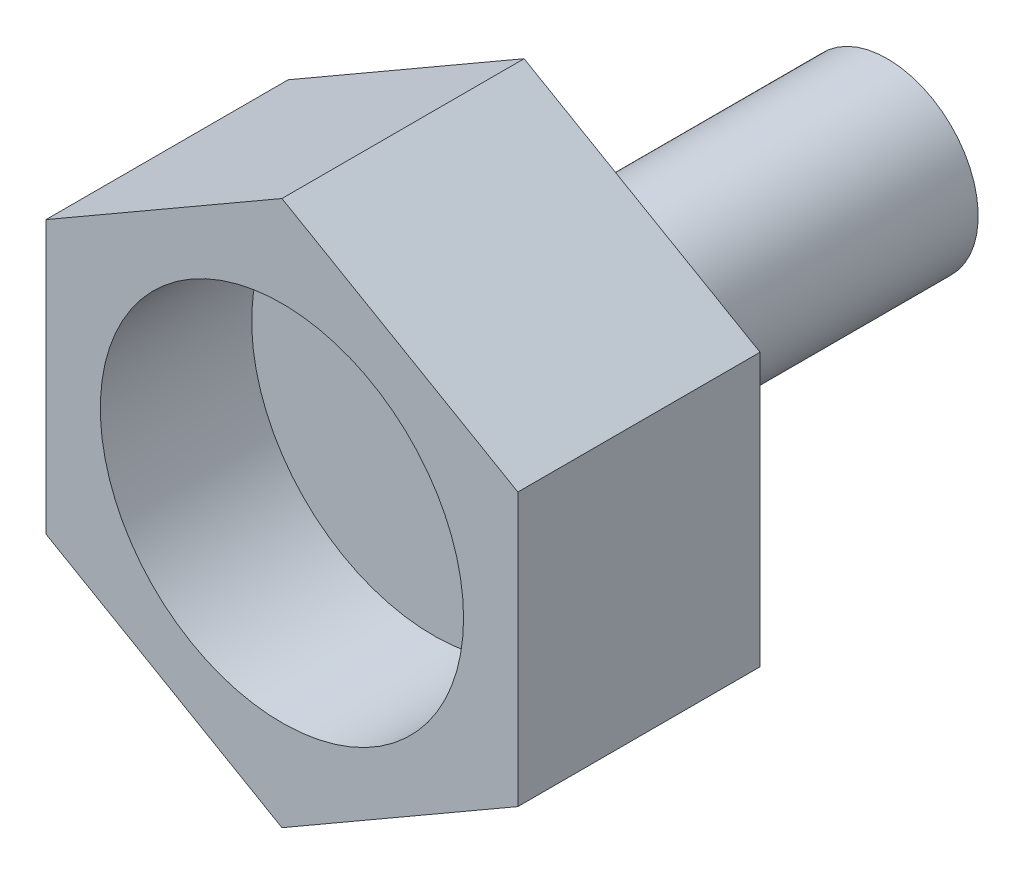
ISO-10303-21;
HEADER;
FILE_DESCRIPTION(('STEP AP214'),'2;1');
FILE_NAME('part.step','',(''),(''),'','','');
FILE_SCHEMA(('AUTOMOTIVE_DESIGN { 1 0 10303 214 1 1 1 1 }'));
ENDSEC;
DATA;
#1=APPLICATION_CONTEXT('core data for automotive mechanical design processes');
#2=APPLICATION_PROTOCOL_DEFINITION('international standard','automotive_design',2000,#1);
#3=PRODUCT_CONTEXT('',#1,'mechanical');
#4=PRODUCT('Part','Part','',(#3));
#5=PRODUCT_RELATED_PRODUCT_CATEGORY('part','',(#4));
#6=PRODUCT_DEFINITION_FORMATION('','',#4);
#7=PRODUCT_DEFINITION_CONTEXT('part definition',#1,'design');
#8=PRODUCT_DEFINITION('design','',#6,#7);
#9=PRODUCT_DEFINITION_SHAPE('','',#8);
#10=(LENGTH_UNIT() NAMED_UNIT(*) SI_UNIT(.MILLI.,.METRE.));
#11=(NAMED_UNIT(*) PLANE_ANGLE_UNIT() SI_UNIT($,.RADIAN.));
#12=(NAMED_UNIT(*) SI_UNIT($,.STERADIAN.) SOLID_ANGLE_UNIT());
#13=UNCERTAINTY_MEASURE_WITH_UNIT(LENGTH_MEASURE(1.E-05),#10,'distance_accuracy_value','');
#14=(GEOMETRIC_REPRESENTATION_CONTEXT(3) GLOBAL_UNCERTAINTY_ASSIGNED_CONTEXT((#13)) GLOBAL_UNIT_ASSIGNED_CONTEXT((#10,
#11,#12)) REPRESENTATION_CONTEXT('',''));
#15=CARTESIAN_POINT('',(0.,0.,0.));
#16=DIRECTION('',(0.,0.,1.));
#17=DIRECTION('',(1.,0.,0.));
#18=AXIS2_PLACEMENT_3D('',#15,#16,#17);
#19=CARTESIAN_POINT('',(0.,-4.5,4.));
#20=DIRECTION('',(-0.5,0.866025403784439,0.));
#21=DIRECTION('',(-0.866025403784439,-0.5,0.));
#22=AXIS2_PLACEMENT_3D('',#19,#20,#21);
#23=PLANE('',#22);
#24=DIRECTION('',(0.866025403784439,0.5,0.));
#25=VECTOR('',#24,1.);
#26=CARTESIAN_POINT('',(0.,-4.5,0.));
#27=LINE('',#26,#25);
#28=CARTESIAN_POINT('',(0.,-4.5,0.));
#29=VERTEX_POINT('',#28);
#30=CARTESIAN_POINT('',(3.89711431702997,-2.25,0.));
#31=VERTEX_POINT('',#30);
#32=EDGE_CURVE('E119',#29,#31,#27,.T.);
#33=ORIENTED_EDGE('',*,*,#32,.T.);
#34=DIRECTION('',(0.,0.,-1.));
#35=VECTOR('',#34,1.);
#36=CARTESIAN_POINT('',(3.89711431702997,-2.25,4.));
#37=LINE('',#36,#35);
#38=CARTESIAN_POINT('',(3.89711431702997,-2.25,4.));
#39=VERTEX_POINT('',#38);
#40=EDGE_CURVE('E36',#39,#31,#37,.T.);
#41=ORIENTED_EDGE('',*,*,#40,.F.);
#42=DIRECTION('',(0.866025403784439,0.5,0.));
#43=VECTOR('',#42,1.);
#44=CARTESIAN_POINT('',(0.,-4.5,4.));
#45=LINE('',#44,#43);
#46=CARTESIAN_POINT('',(0.,-4.5,4.));
#47=VERTEX_POINT('',#46);
#48=EDGE_CURVE('E130',#47,#39,#45,.T.);
#49=ORIENTED_EDGE('',*,*,#48,.F.);
#50=DIRECTION('',(0.,0.,-1.));
#51=VECTOR('',#50,1.);
#52=CARTESIAN_POINT('',(0.,-4.5,4.));
#53=LINE('',#52,#51);
#54=EDGE_CURVE('E115',#47,#29,#53,.T.);
#55=ORIENTED_EDGE('',*,*,#54,.T.);
#56=EDGE_LOOP('',(#33,#41,#49,#55));
#57=FACE_BOUND('',#56,.T.);
#58=ADVANCED_FACE('F33',(#57),#23,.F.);
#59=CARTESIAN_POINT('',(3.89711431702997,-2.25,4.));
#60=DIRECTION('',(-1.,0.,0.));
#61=DIRECTION('',(0.,-1.,0.));
#62=AXIS2_PLACEMENT_3D('',#59,#60,#61);
#63=PLANE('',#62);
#64=DIRECTION('',(0.,1.,0.));
#65=VECTOR('',#64,1.);
#66=CARTESIAN_POINT('',(3.89711431702997,-2.25,0.));
#67=LINE('',#66,#65);
#68=CARTESIAN_POINT('',(3.89711431702997,2.25,0.));
#69=VERTEX_POINT('',#68);
#70=EDGE_CURVE('E122',#31,#69,#67,.T.);
#71=ORIENTED_EDGE('',*,*,#70,.T.);
#72=DIRECTION('',(0.,0.,-1.));
#73=VECTOR('',#72,1.);
#74=CARTESIAN_POINT('',(3.89711431702997,2.25,4.));
#75=LINE('',#74,#73);
#76=CARTESIAN_POINT('',(3.89711431702997,2.25,4.));
#77=VERTEX_POINT('',#76);
#78=EDGE_CURVE('E133',#77,#69,#75,.T.);
#79=ORIENTED_EDGE('',*,*,#78,.F.);
#80=DIRECTION('',(0.,1.,0.));
#81=VECTOR('',#80,1.);
#82=CARTESIAN_POINT('',(3.89711431702997,-2.25,4.));
#83=LINE('',#82,#81);
#84=EDGE_CURVE('E88',#39,#77,#83,.T.);
#85=ORIENTED_EDGE('',*,*,#84,.F.);
#86=ORIENTED_EDGE('',*,*,#40,.T.);
#87=EDGE_LOOP('',(#71,#79,#85,#86));
#88=FACE_BOUND('',#87,.T.);
#89=ADVANCED_FACE('F138',(#88),#63,.F.);
#90=CARTESIAN_POINT('',(3.89711431702997,2.25,4.));
#91=DIRECTION('',(-0.5,-0.866025403784439,0.));
#92=DIRECTION('',(0.866025403784439,-0.5,0.));
#93=AXIS2_PLACEMENT_3D('',#90,#91,#92);
#94=PLANE('',#93);
#95=DIRECTION('',(-0.866025403784439,0.5,0.));
#96=VECTOR('',#95,1.);
#97=CARTESIAN_POINT('',(3.89711431702997,2.25,0.));
#98=LINE('',#97,#96);
#99=CARTESIAN_POINT('',(0.,4.5,0.));
#100=VERTEX_POINT('',#99);
#101=EDGE_CURVE('E125',#69,#100,#98,.T.);
#102=ORIENTED_EDGE('',*,*,#101,.T.);
#103=DIRECTION('',(0.,0.,-1.));
#104=VECTOR('',#103,1.);
#105=CARTESIAN_POINT('',(0.,4.5,4.));
#106=LINE('',#105,#104);
#107=CARTESIAN_POINT('',(0.,4.5,4.));
#108=VERTEX_POINT('',#107);
#109=EDGE_CURVE('E110',#108,#100,#106,.T.);
#110=ORIENTED_EDGE('',*,*,#109,.F.);
#111=DIRECTION('',(-0.866025403784439,0.5,0.));
#112=VECTOR('',#111,1.);
#113=CARTESIAN_POINT('',(3.89711431702997,2.25,4.));
#114=LINE('',#113,#112);
#115=EDGE_CURVE('E101',#77,#108,#114,.T.);
#116=ORIENTED_EDGE('',*,*,#115,.F.);
#117=ORIENTED_EDGE('',*,*,#78,.T.);
#118=EDGE_LOOP('',(#102,#110,#116,#117));
#119=FACE_BOUND('',#118,.T.);
#120=ADVANCED_FACE('F144',(#119),#94,.F.);
#121=CARTESIAN_POINT('',(0.,4.5,4.));
#122=DIRECTION('',(0.5,-0.866025403784439,0.));
#123=DIRECTION('',(0.866025403784439,0.5,0.));
#124=AXIS2_PLACEMENT_3D('',#121,#122,#123);
#125=PLANE('',#124);
#126=DIRECTION('',(-0.866025403784439,-0.5,0.));
#127=VECTOR('',#126,1.);
#128=CARTESIAN_POINT('',(0.,4.5,0.));
#129=LINE('',#128,#127);
#130=CARTESIAN_POINT('',(-3.89711431702997,2.25,0.));
#131=VERTEX_POINT('',#130);
#132=EDGE_CURVE('E109',#100,#131,#129,.T.);
#133=ORIENTED_EDGE('',*,*,#132,.T.);
#134=DIRECTION('',(0.,0.,-1.));
#135=VECTOR('',#134,1.);
#136=CARTESIAN_POINT('',(-3.89711431702997,2.25,4.));
#137=LINE('',#136,#135);
#138=CARTESIAN_POINT('',(-3.89711431702997,2.25,4.));
#139=VERTEX_POINT('',#138);
#140=EDGE_CURVE('E106',#139,#131,#137,.T.);
#141=ORIENTED_EDGE('',*,*,#140,.F.);
#142=DIRECTION('',(-0.866025403784439,-0.5,0.));
#143=VECTOR('',#142,1.);
#144=CARTESIAN_POINT('',(0.,4.5,4.));
#145=LINE('',#144,#143);
#146=EDGE_CURVE('E95',#108,#139,#145,.T.);
#147=ORIENTED_EDGE('',*,*,#146,.F.);
#148=ORIENTED_EDGE('',*,*,#109,.T.);
#149=EDGE_LOOP('',(#133,#141,#147,#148));
#150=FACE_BOUND('',#149,.T.);
#151=ADVANCED_FACE('F107',(#150),#125,.F.);
#152=CARTESIAN_POINT('',(-3.89711431702997,2.25,4.));
#153=DIRECTION('',(1.,0.,0.));
#154=DIRECTION('',(0.,1.,0.));
#155=AXIS2_PLACEMENT_3D('',#152,#153,#154);
#156=PLANE('',#155);
#157=DIRECTION('',(0.,-1.,0.));
#158=VECTOR('',#157,1.);
#159=CARTESIAN_POINT('',(-3.89711431702997,2.25,0.));
#160=LINE('',#159,#158);
#161=CARTESIAN_POINT('',(-3.89711431702997,-2.25,0.));
#162=VERTEX_POINT('',#161);
#163=EDGE_CURVE('E73',#131,#162,#160,.T.);
#164=ORIENTED_EDGE('',*,*,#163,.T.);
#165=DIRECTION('',(0.,0.,-1.));
#166=VECTOR('',#165,1.);
#167=CARTESIAN_POINT('',(-3.89711431702997,-2.25,4.));
#168=LINE('',#167,#166);
#169=CARTESIAN_POINT('',(-3.89711431702997,-2.25,4.));
#170=VERTEX_POINT('',#169);
#171=EDGE_CURVE('E111',#170,#162,#168,.T.);
#172=ORIENTED_EDGE('',*,*,#171,.F.);
#173=DIRECTION('',(0.,-1.,0.));
#174=VECTOR('',#173,1.);
#175=CARTESIAN_POINT('',(-3.89711431702997,2.25,4.));
#176=LINE('',#175,#174);
#177=EDGE_CURVE('E99',#139,#170,#176,.T.);
#178=ORIENTED_EDGE('',*,*,#177,.F.);
#179=ORIENTED_EDGE('',*,*,#140,.T.);
#180=EDGE_LOOP('',(#164,#172,#178,#179));
#181=FACE_BOUND('',#180,.T.);
#182=ADVANCED_FACE('F113',(#181),#156,.F.);
#183=CARTESIAN_POINT('',(-3.89711431702997,-2.25,4.));
#184=DIRECTION('',(0.5,0.866025403784439,0.));
#185=DIRECTION('',(-0.866025403784439,0.5,0.));
#186=AXIS2_PLACEMENT_3D('',#183,#184,#185);
#187=PLANE('',#186);
#188=DIRECTION('',(0.866025403784439,-0.5,0.));
#189=VECTOR('',#188,1.);
#190=CARTESIAN_POINT('',(-3.89711431702997,-2.25,0.));
#191=LINE('',#190,#189);
#192=EDGE_CURVE('E79',#162,#29,#191,.T.);
#193=ORIENTED_EDGE('',*,*,#192,.T.);
#194=ORIENTED_EDGE('',*,*,#54,.F.);
#195=DIRECTION('',(0.866025403784439,-0.5,0.));
#196=VECTOR('',#195,1.);
#197=CARTESIAN_POINT('',(-3.89711431702997,-2.25,4.));
#198=LINE('',#197,#196);
#199=EDGE_CURVE('E50',#170,#47,#198,.T.);
#200=ORIENTED_EDGE('',*,*,#199,.F.);
#201=ORIENTED_EDGE('',*,*,#171,.T.);
#202=EDGE_LOOP('',(#193,#194,#200,#201));
#203=FACE_BOUND('',#202,.T.);
#204=ADVANCED_FACE('F167',(#203),#187,.F.);
#205=CARTESIAN_POINT('',(0.,0.,4.));
#206=DIRECTION('',(0.,0.,1.));
#207=DIRECTION('',(1.,0.,0.));
#208=AXIS2_PLACEMENT_3D('',#205,#206,#207);
#209=PLANE('',#208);
#210=CARTESIAN_POINT('',(0.,0.,4.));
#211=DIRECTION('',(0.,0.,1.));
#212=DIRECTION('',(1.,0.,0.));
#213=AXIS2_PLACEMENT_3D('',#210,#211,#212);
#214=CIRCLE('',#213,3.);
#215=CARTESIAN_POINT('',(3.,0.,4.));
#216=VERTEX_POINT('',#215);
#217=EDGE_CURVE('E151',#216,#216,#214,.T.);
#218=ORIENTED_EDGE('',*,*,#217,.F.);
#219=EDGE_LOOP('',(#218));
#220=FACE_BOUND('',#219,.T.);
#221=ORIENTED_EDGE('',*,*,#48,.T.);
#222=ORIENTED_EDGE('',*,*,#84,.T.);
#223=ORIENTED_EDGE('',*,*,#115,.T.);
#224=ORIENTED_EDGE('',*,*,#146,.T.);
#225=ORIENTED_EDGE('',*,*,#177,.T.);
#226=ORIENTED_EDGE('',*,*,#199,.T.);
#227=EDGE_LOOP('',(#221,#222,#223,#224,#225,#226));
#228=FACE_BOUND('',#227,.T.);
#229=ADVANCED_FACE('F97',(#220,#228),#209,.T.);
#230=CARTESIAN_POINT('',(0.,0.,0.));
#231=DIRECTION('',(0.,0.,1.));
#232=DIRECTION('',(1.,0.,0.));
#233=AXIS2_PLACEMENT_3D('',#230,#231,#232);
#234=PLANE('',#233);
#235=CARTESIAN_POINT('',(0.,0.,0.));
#236=DIRECTION('',(0.,0.,-1.));
#237=DIRECTION('',(-1.,0.,0.));
#238=AXIS2_PLACEMENT_3D('',#235,#236,#237);
#239=CIRCLE('',#238,1.5);
#240=CARTESIAN_POINT('',(-1.5,0.,0.));
#241=VERTEX_POINT('',#240);
#242=EDGE_CURVE('E11',#241,#241,#239,.T.);
#243=ORIENTED_EDGE('',*,*,#242,.F.);
#244=EDGE_LOOP('',(#243));
#245=FACE_BOUND('',#244,.T.);
#246=ORIENTED_EDGE('',*,*,#32,.F.);
#247=ORIENTED_EDGE('',*,*,#192,.F.);
#248=ORIENTED_EDGE('',*,*,#163,.F.);
#249=ORIENTED_EDGE('',*,*,#132,.F.);
#250=ORIENTED_EDGE('',*,*,#101,.F.);
#251=ORIENTED_EDGE('',*,*,#70,.F.);
#252=EDGE_LOOP('',(#246,#247,#248,#249,#250,#251));
#253=FACE_BOUND('',#252,.T.);
#254=ADVANCED_FACE('F143',(#245,#253),#234,.F.);
#255=CARTESIAN_POINT('',(0.,0.,-6.));
#256=DIRECTION('',(0.,0.,1.));
#257=DIRECTION('',(1.,0.,0.));
#258=AXIS2_PLACEMENT_3D('',#255,#256,#257);
#259=CYLINDRICAL_SURFACE('',#258,1.5);
#260=CARTESIAN_POINT('',(0.,0.,-6.));
#261=DIRECTION('',(0.,0.,-1.));
#262=DIRECTION('',(-1.,0.,0.));
#263=AXIS2_PLACEMENT_3D('',#260,#261,#262);
#264=CIRCLE('',#263,1.5);
#265=CARTESIAN_POINT('',(-1.5,0.,-6.));
#266=VERTEX_POINT('',#265);
#267=EDGE_CURVE('E123',#266,#266,#264,.T.);
#268=ORIENTED_EDGE('',*,*,#267,.F.);
#269=EDGE_LOOP('',(#268));
#270=FACE_BOUND('',#269,.T.);
#271=ORIENTED_EDGE('',*,*,#242,.T.);
#272=EDGE_LOOP('',(#271));
#273=FACE_BOUND('',#272,.T.);
#274=ADVANCED_FACE('F173',(#270,#273),#259,.T.);
#275=CARTESIAN_POINT('',(0.,0.,-6.));
#276=DIRECTION('',(0.,0.,-1.));
#277=DIRECTION('',(-1.,0.,0.));
#278=AXIS2_PLACEMENT_3D('',#275,#276,#277);
#279=PLANE('',#278);
#280=ORIENTED_EDGE('',*,*,#267,.T.);
#281=EDGE_LOOP('',(#280));
#282=FACE_BOUND('',#281,.T.);
#283=ADVANCED_FACE('F162',(#282),#279,.T.);
#284=CARTESIAN_POINT('',(0.,0.,1.5));
#285=DIRECTION('',(0.,0.,1.));
#286=DIRECTION('',(1.,0.,0.));
#287=AXIS2_PLACEMENT_3D('',#284,#285,#286);
#288=CYLINDRICAL_SURFACE('',#287,3.);
#289=CARTESIAN_POINT('',(0.,0.,1.5));
#290=DIRECTION('',(0.,0.,1.));
#291=DIRECTION('',(1.,0.,0.));
#292=AXIS2_PLACEMENT_3D('',#289,#290,#291);
#293=CIRCLE('',#292,3.);
#294=CARTESIAN_POINT('',(3.,0.,1.5));
#295=VERTEX_POINT('',#294);
#296=EDGE_CURVE('E150',#295,#295,#293,.T.);
#297=ORIENTED_EDGE('',*,*,#296,.F.);
#298=EDGE_LOOP('',(#297));
#299=FACE_BOUND('',#298,.T.);
#300=ORIENTED_EDGE('',*,*,#217,.T.);
#301=EDGE_LOOP('',(#300));
#302=FACE_BOUND('',#301,.T.);
#303=ADVANCED_FACE('F159',(#299,#302),#288,.F.);
#304=CARTESIAN_POINT('',(0.,0.,1.5));
#305=DIRECTION('',(0.,0.,1.));
#306=DIRECTION('',(1.,0.,0.));
#307=AXIS2_PLACEMENT_3D('',#304,#305,#306);
#308=PLANE('',#307);
#309=ORIENTED_EDGE('',*,*,#296,.T.);
#310=EDGE_LOOP('',(#309));
#311=FACE_BOUND('',#310,.T.);
#312=ADVANCED_FACE('F157',(#311),#308,.T.);
#313=CLOSED_SHELL('',(#58,#89,#120,#151,#182,#204,#229,#254,#274,#283,#303,#312));
#314=MANIFOLD_SOLID_BREP('B2',#313);
#315=ADVANCED_BREP_SHAPE_REPRESENTATION('',(#18,#314),#14);
#316=SHAPE_DEFINITION_REPRESENTATION(#9,#315);
ENDSEC;
END-ISO-10303-21;
